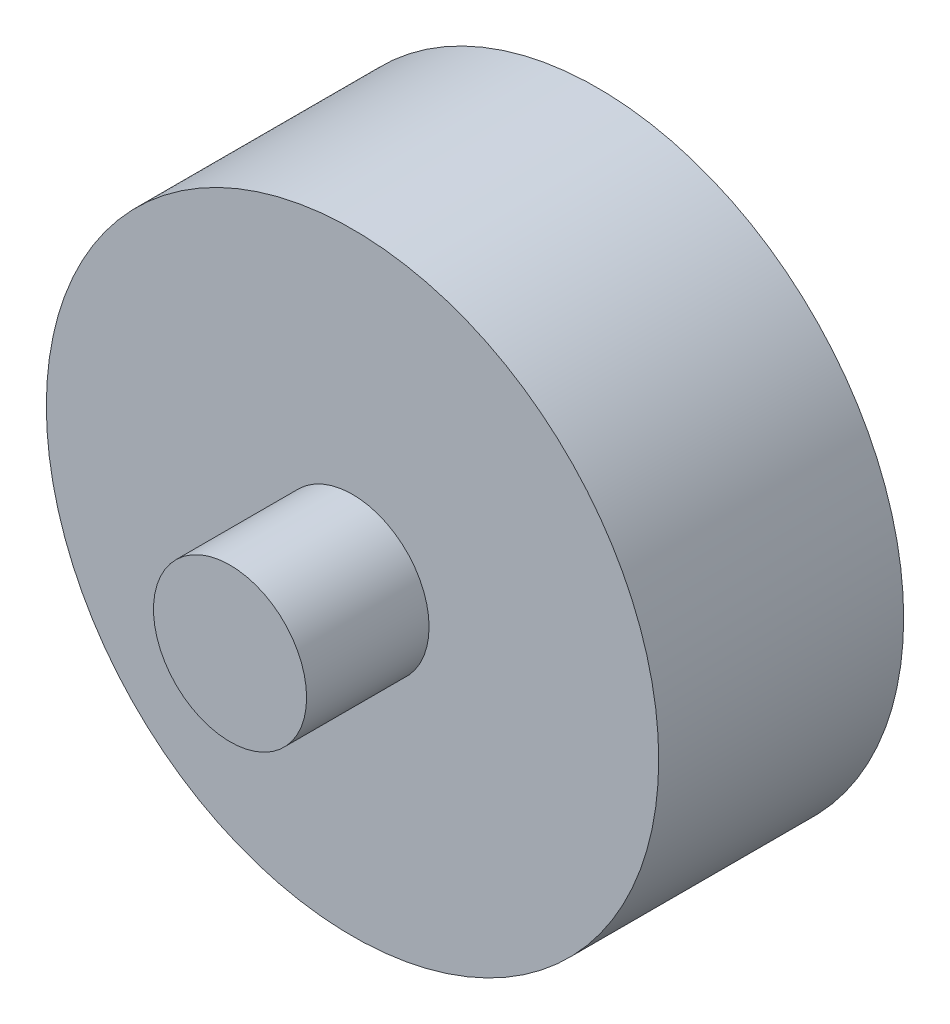
ISO-10303-21;
HEADER;
FILE_DESCRIPTION(('STEP AP214'),'2;1');
FILE_NAME('part.step','',(''),(''),'','','');
FILE_SCHEMA(('AUTOMOTIVE_DESIGN { 1 0 10303 214 1 1 1 1 }'));
ENDSEC;
DATA;
#1=APPLICATION_CONTEXT('core data for automotive mechanical design processes');
#2=APPLICATION_PROTOCOL_DEFINITION('international standard','automotive_design',2000,#1);
#3=PRODUCT_CONTEXT('',#1,'mechanical');
#4=PRODUCT('Part','Part','',(#3));
#5=PRODUCT_RELATED_PRODUCT_CATEGORY('part','',(#4));
#6=PRODUCT_DEFINITION_FORMATION('','',#4);
#7=PRODUCT_DEFINITION_CONTEXT('part definition',#1,'design');
#8=PRODUCT_DEFINITION('design','',#6,#7);
#9=PRODUCT_DEFINITION_SHAPE('','',#8);
#10=(LENGTH_UNIT() NAMED_UNIT(*) SI_UNIT(.MILLI.,.METRE.));
#11=(NAMED_UNIT(*) PLANE_ANGLE_UNIT() SI_UNIT($,.RADIAN.));
#12=(NAMED_UNIT(*) SI_UNIT($,.STERADIAN.) SOLID_ANGLE_UNIT());
#13=UNCERTAINTY_MEASURE_WITH_UNIT(LENGTH_MEASURE(1.E-05),#10,'distance_accuracy_value','');
#14=(GEOMETRIC_REPRESENTATION_CONTEXT(3) GLOBAL_UNCERTAINTY_ASSIGNED_CONTEXT((#13)) GLOBAL_UNIT_ASSIGNED_CONTEXT((#10,
#11,#12)) REPRESENTATION_CONTEXT('',''));
#15=CARTESIAN_POINT('',(0.,0.,0.));
#16=DIRECTION('',(0.,0.,1.));
#17=DIRECTION('',(1.,0.,0.));
#18=AXIS2_PLACEMENT_3D('',#15,#16,#17);
#19=CARTESIAN_POINT('',(10.,10.,12.));
#20=DIRECTION('',(0.,0.,-1.));
#21=DIRECTION('',(-1.,0.,0.));
#22=AXIS2_PLACEMENT_3D('',#19,#20,#21);
#23=CYLINDRICAL_SURFACE('',#22,2.5);
#24=CARTESIAN_POINT('',(10.,10.,8.));
#25=DIRECTION('',(0.,0.,1.));
#26=DIRECTION('',(1.,0.,0.));
#27=AXIS2_PLACEMENT_3D('',#24,#25,#26);
#28=CIRCLE('',#27,2.5);
#29=CARTESIAN_POINT('',(12.5,10.,8.));
#30=VERTEX_POINT('',#29);
#31=EDGE_CURVE('E46',#30,#30,#28,.T.);
#32=ORIENTED_EDGE('',*,*,#31,.T.);
#33=EDGE_LOOP('',(#32));
#34=FACE_BOUND('',#33,.T.);
#35=CARTESIAN_POINT('',(10.,10.,12.));
#36=DIRECTION('',(0.,0.,1.));
#37=DIRECTION('',(1.,0.,0.));
#38=AXIS2_PLACEMENT_3D('',#35,#36,#37);
#39=CIRCLE('',#38,2.5);
#40=CARTESIAN_POINT('',(12.5,10.,12.));
#41=VERTEX_POINT('',#40);
#42=EDGE_CURVE('E10',#41,#41,#39,.T.);
#43=ORIENTED_EDGE('',*,*,#42,.F.);
#44=EDGE_LOOP('',(#43));
#45=FACE_BOUND('',#44,.T.);
#46=ADVANCED_FACE('F31',(#34,#45),#23,.T.);
#47=CARTESIAN_POINT('',(10.,-12.1414213562373,12.));
#48=DIRECTION('',(0.,0.,1.));
#49=DIRECTION('',(1.,0.,0.));
#50=AXIS2_PLACEMENT_3D('',#47,#48,#49);
#51=PLANE('',#50);
#52=ORIENTED_EDGE('',*,*,#42,.T.);
#53=EDGE_LOOP('',(#52));
#54=FACE_BOUND('',#53,.T.);
#55=ADVANCED_FACE('F56',(#54),#51,.T.);
#56=CARTESIAN_POINT('',(10.,10.,8.));
#57=DIRECTION('',(0.,0.,1.));
#58=DIRECTION('',(1.,0.,0.));
#59=AXIS2_PLACEMENT_3D('',#56,#57,#58);
#60=PLANE('',#59);
#61=CARTESIAN_POINT('',(10.,10.,8.));
#62=DIRECTION('',(0.,0.,1.));
#63=DIRECTION('',(1.,0.,0.));
#64=AXIS2_PLACEMENT_3D('',#61,#62,#63);
#65=CIRCLE('',#64,10.);
#66=CARTESIAN_POINT('',(20.,10.,8.));
#67=VERTEX_POINT('',#66);
#68=EDGE_CURVE('E37',#67,#67,#65,.T.);
#69=ORIENTED_EDGE('',*,*,#68,.T.);
#70=EDGE_LOOP('',(#69));
#71=FACE_BOUND('',#70,.T.);
#72=ORIENTED_EDGE('',*,*,#31,.F.);
#73=EDGE_LOOP('',(#72));
#74=FACE_BOUND('',#73,.T.);
#75=ADVANCED_FACE('F53',(#71,#74),#60,.T.);
#76=CARTESIAN_POINT('',(10.,10.,8.));
#77=DIRECTION('',(0.,0.,-1.));
#78=DIRECTION('',(-1.,0.,0.));
#79=AXIS2_PLACEMENT_3D('',#76,#77,#78);
#80=CYLINDRICAL_SURFACE('',#79,10.);
#81=ORIENTED_EDGE('',*,*,#68,.F.);
#82=EDGE_LOOP('',(#81));
#83=FACE_BOUND('',#82,.T.);
#84=CARTESIAN_POINT('',(10.,10.,0.));
#85=DIRECTION('',(0.,0.,1.));
#86=DIRECTION('',(1.,0.,0.));
#87=AXIS2_PLACEMENT_3D('',#84,#85,#86);
#88=CIRCLE('',#87,10.);
#89=CARTESIAN_POINT('',(20.,10.,0.));
#90=VERTEX_POINT('',#89);
#91=EDGE_CURVE('E41',#90,#90,#88,.T.);
#92=ORIENTED_EDGE('',*,*,#91,.T.);
#93=EDGE_LOOP('',(#92));
#94=FACE_BOUND('',#93,.T.);
#95=ADVANCED_FACE('F55',(#83,#94),#80,.T.);
#96=CARTESIAN_POINT('',(10.,-12.1414213562373,0.));
#97=DIRECTION('',(0.,0.,1.));
#98=DIRECTION('',(1.,0.,0.));
#99=AXIS2_PLACEMENT_3D('',#96,#97,#98);
#100=PLANE('',#99);
#101=ORIENTED_EDGE('',*,*,#91,.F.);
#102=EDGE_LOOP('',(#101));
#103=FACE_BOUND('',#102,.T.);
#104=ADVANCED_FACE('F62',(#103),#100,.F.);
#105=CLOSED_SHELL('',(#46,#55,#75,#95,#104));
#106=MANIFOLD_SOLID_BREP('B2',#105);
#107=ADVANCED_BREP_SHAPE_REPRESENTATION('',(#18,#106),#14);
#108=SHAPE_DEFINITION_REPRESENTATION(#9,#107);
ENDSEC;
END-ISO-10303-21;
